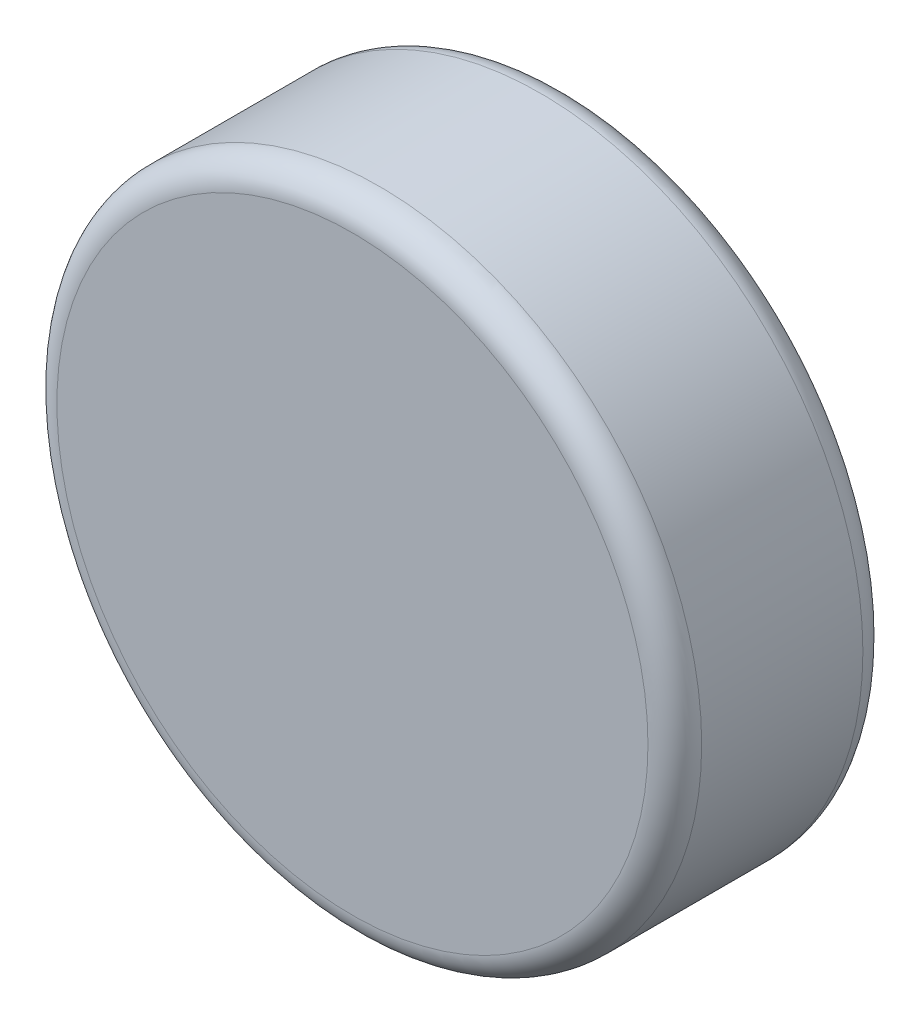
ISO-10303-21;
HEADER;
FILE_DESCRIPTION(('STEP AP214'),'2;1');
FILE_NAME('part.step','',(''),(''),'','','');
FILE_SCHEMA(('AUTOMOTIVE_DESIGN { 1 0 10303 214 1 1 1 1 }'));
ENDSEC;
DATA;
#1=APPLICATION_CONTEXT('core data for automotive mechanical design processes');
#2=APPLICATION_PROTOCOL_DEFINITION('international standard','automotive_design',2000,#1);
#3=PRODUCT_CONTEXT('',#1,'mechanical');
#4=PRODUCT('Part','Part','',(#3));
#5=PRODUCT_RELATED_PRODUCT_CATEGORY('part','',(#4));
#6=PRODUCT_DEFINITION_FORMATION('','',#4);
#7=PRODUCT_DEFINITION_CONTEXT('part definition',#1,'design');
#8=PRODUCT_DEFINITION('design','',#6,#7);
#9=PRODUCT_DEFINITION_SHAPE('','',#8);
#10=(LENGTH_UNIT() NAMED_UNIT(*) SI_UNIT(.MILLI.,.METRE.));
#11=(NAMED_UNIT(*) PLANE_ANGLE_UNIT() SI_UNIT($,.RADIAN.));
#12=(NAMED_UNIT(*) SI_UNIT($,.STERADIAN.) SOLID_ANGLE_UNIT());
#13=UNCERTAINTY_MEASURE_WITH_UNIT(LENGTH_MEASURE(1.E-05),#10,'distance_accuracy_value','');
#14=(GEOMETRIC_REPRESENTATION_CONTEXT(3) GLOBAL_UNCERTAINTY_ASSIGNED_CONTEXT((#13)) GLOBAL_UNIT_ASSIGNED_CONTEXT((#10,
#11,#12)) REPRESENTATION_CONTEXT('',''));
#15=CARTESIAN_POINT('',(0.,0.,0.));
#16=DIRECTION('',(0.,0.,1.));
#17=DIRECTION('',(1.,0.,0.));
#18=AXIS2_PLACEMENT_3D('',#15,#16,#17);
#19=CARTESIAN_POINT('',(0.,0.,2.));
#20=DIRECTION('',(0.,0.,-1.));
#21=DIRECTION('',(-1.,0.,0.));
#22=AXIS2_PLACEMENT_3D('',#19,#20,#21);
#23=CYLINDRICAL_SURFACE('',#22,3.);
#24=CARTESIAN_POINT('',(0.,0.,1.75));
#25=DIRECTION('',(0.,0.,1.));
#26=DIRECTION('',(1.,0.,0.));
#27=AXIS2_PLACEMENT_3D('',#24,#25,#26);
#28=CIRCLE('',#27,3.);
#29=CARTESIAN_POINT('',(3.,0.,1.75));
#30=VERTEX_POINT('',#29);
#31=EDGE_CURVE('E39',#30,#30,#28,.F.);
#32=ORIENTED_EDGE('',*,*,#31,.T.);
#33=EDGE_LOOP('',(#32));
#34=FACE_BOUND('',#33,.T.);
#35=CARTESIAN_POINT('',(0.,0.,0.25));
#36=DIRECTION('',(0.,0.,1.));
#37=DIRECTION('',(1.,0.,0.));
#38=AXIS2_PLACEMENT_3D('',#35,#36,#37);
#39=CIRCLE('',#38,3.);
#40=CARTESIAN_POINT('',(3.,0.,0.25));
#41=VERTEX_POINT('',#40);
#42=EDGE_CURVE('E43',#41,#41,#39,.T.);
#43=ORIENTED_EDGE('',*,*,#42,.T.);
#44=EDGE_LOOP('',(#43));
#45=FACE_BOUND('',#44,.T.);
#46=ADVANCED_FACE('F32',(#34,#45),#23,.T.);
#47=CARTESIAN_POINT('',(0.,0.,2.));
#48=DIRECTION('',(0.,0.,1.));
#49=DIRECTION('',(1.,0.,0.));
#50=AXIS2_PLACEMENT_3D('',#47,#48,#49);
#51=PLANE('',#50);
#52=CARTESIAN_POINT('',(0.,0.,2.));
#53=DIRECTION('',(0.,0.,1.));
#54=DIRECTION('',(1.,0.,0.));
#55=AXIS2_PLACEMENT_3D('',#52,#53,#54);
#56=CIRCLE('',#55,2.75);
#57=CARTESIAN_POINT('',(2.75,0.,2.));
#58=VERTEX_POINT('',#57);
#59=EDGE_CURVE('E47',#58,#58,#56,.T.);
#60=ORIENTED_EDGE('',*,*,#59,.T.);
#61=EDGE_LOOP('',(#60));
#62=FACE_BOUND('',#61,.T.);
#63=ADVANCED_FACE('F53',(#62),#51,.T.);
#64=CARTESIAN_POINT('',(0.,0.,0.));
#65=DIRECTION('',(0.,0.,1.));
#66=DIRECTION('',(1.,0.,0.));
#67=AXIS2_PLACEMENT_3D('',#64,#65,#66);
#68=PLANE('',#67);
#69=CARTESIAN_POINT('',(0.,0.,0.));
#70=DIRECTION('',(0.,0.,1.));
#71=DIRECTION('',(1.,0.,0.));
#72=AXIS2_PLACEMENT_3D('',#69,#70,#71);
#73=CIRCLE('',#72,2.75);
#74=CARTESIAN_POINT('',(2.75,0.,0.));
#75=VERTEX_POINT('',#74);
#76=EDGE_CURVE('E10',#75,#75,#73,.F.);
#77=ORIENTED_EDGE('',*,*,#76,.T.);
#78=EDGE_LOOP('',(#77));
#79=FACE_BOUND('',#78,.T.);
#80=ADVANCED_FACE('F57',(#79),#68,.F.);
#81=CARTESIAN_POINT('',(0.,0.,1.75));
#82=DIRECTION('',(0.,0.,1.));
#83=DIRECTION('',(1.,0.,0.));
#84=AXIS2_PLACEMENT_3D('',#81,#82,#83);
#85=TOROIDAL_SURFACE('',#84,2.75,0.25);
#86=ORIENTED_EDGE('',*,*,#31,.F.);
#87=EDGE_LOOP('',(#86));
#88=FACE_BOUND('',#87,.T.);
#89=ORIENTED_EDGE('',*,*,#59,.F.);
#90=EDGE_LOOP('',(#89));
#91=FACE_BOUND('',#90,.T.);
#92=ADVANCED_FACE('F55',(#88,#91),#85,.T.);
#93=CARTESIAN_POINT('',(0.,0.,0.25));
#94=DIRECTION('',(0.,0.,1.));
#95=DIRECTION('',(1.,0.,0.));
#96=AXIS2_PLACEMENT_3D('',#93,#94,#95);
#97=TOROIDAL_SURFACE('',#96,2.75,0.25);
#98=ORIENTED_EDGE('',*,*,#76,.F.);
#99=EDGE_LOOP('',(#98));
#100=FACE_BOUND('',#99,.T.);
#101=ORIENTED_EDGE('',*,*,#42,.F.);
#102=EDGE_LOOP('',(#101));
#103=FACE_BOUND('',#102,.T.);
#104=ADVANCED_FACE('F34',(#100,#103),#97,.T.);
#105=CLOSED_SHELL('',(#46,#63,#80,#92,#104));
#106=MANIFOLD_SOLID_BREP('B2',#105);
#107=ADVANCED_BREP_SHAPE_REPRESENTATION('',(#18,#106),#14);
#108=SHAPE_DEFINITION_REPRESENTATION(#9,#107);
ENDSEC;
END-ISO-10303-21;
